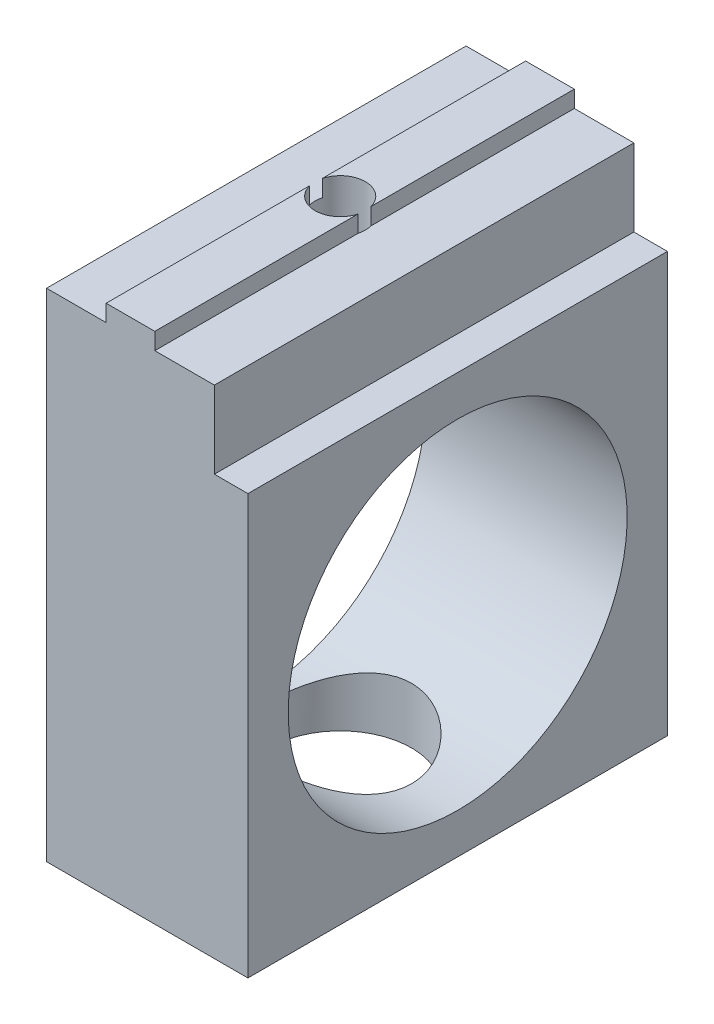
ISO-10303-21;
HEADER;
FILE_DESCRIPTION(('STEP AP214'),'2;1');
FILE_NAME('part.step','',(''),(''),'','','');
FILE_SCHEMA(('AUTOMOTIVE_DESIGN { 1 0 10303 214 1 1 1 1 }'));
ENDSEC;
DATA;
#1=APPLICATION_CONTEXT('core data for automotive mechanical design processes');
#2=APPLICATION_PROTOCOL_DEFINITION('international standard','automotive_design',2000,#1);
#3=PRODUCT_CONTEXT('',#1,'mechanical');
#4=PRODUCT('Part','Part','',(#3));
#5=PRODUCT_RELATED_PRODUCT_CATEGORY('part','',(#4));
#6=PRODUCT_DEFINITION_FORMATION('','',#4);
#7=PRODUCT_DEFINITION_CONTEXT('part definition',#1,'design');
#8=PRODUCT_DEFINITION('design','',#6,#7);
#9=PRODUCT_DEFINITION_SHAPE('','',#8);
#10=(LENGTH_UNIT() NAMED_UNIT(*) SI_UNIT(.MILLI.,.METRE.));
#11=(NAMED_UNIT(*) PLANE_ANGLE_UNIT() SI_UNIT($,.RADIAN.));
#12=(NAMED_UNIT(*) SI_UNIT($,.STERADIAN.) SOLID_ANGLE_UNIT());
#13=UNCERTAINTY_MEASURE_WITH_UNIT(LENGTH_MEASURE(1.E-05),#10,'distance_accuracy_value','');
#14=(GEOMETRIC_REPRESENTATION_CONTEXT(3) GLOBAL_UNCERTAINTY_ASSIGNED_CONTEXT((#13)) GLOBAL_UNIT_ASSIGNED_CONTEXT((#10,
#11,#12)) REPRESENTATION_CONTEXT('',''));
#15=CARTESIAN_POINT('',(0.,0.,0.));
#16=DIRECTION('',(0.,0.,1.));
#17=DIRECTION('',(1.,0.,0.));
#18=AXIS2_PLACEMENT_3D('',#15,#16,#17);
#19=CARTESIAN_POINT('',(1.45,7.,12.5));
#20=DIRECTION('',(-1.,0.,0.));
#21=DIRECTION('',(0.,-1.,0.));
#22=AXIS2_PLACEMENT_3D('',#19,#20,#21);
#23=PLANE('',#22);
#24=DIRECTION('',(0.,0.,-1.));
#25=VECTOR('',#24,1.);
#26=CARTESIAN_POINT('',(1.45,8.,12.5));
#27=LINE('',#26,#25);
#28=CARTESIAN_POINT('',(1.45,8.00000000000001,-0.384057287393411));
#29=VERTEX_POINT('',#28);
#30=CARTESIAN_POINT('',(1.45,8.,-12.5));
#31=VERTEX_POINT('',#30);
#32=EDGE_CURVE('E167',#29,#31,#27,.T.);
#33=ORIENTED_EDGE('',*,*,#32,.F.);
#34=DIRECTION('',(0.,-1.,0.));
#35=VECTOR('',#34,1.);
#36=CARTESIAN_POINT('',(1.45,8.00000000000001,-0.384057287393411));
#37=LINE('',#36,#35);
#38=CARTESIAN_POINT('',(1.45,7.,-0.384057287393411));
#39=VERTEX_POINT('',#38);
#40=EDGE_CURVE('E236',#29,#39,#37,.T.);
#41=ORIENTED_EDGE('',*,*,#40,.T.);
#42=DIRECTION('',(0.,0.,-1.));
#43=VECTOR('',#42,1.);
#44=CARTESIAN_POINT('',(1.45,7.,12.5));
#45=LINE('',#44,#43);
#46=CARTESIAN_POINT('',(1.45,7.,-12.5));
#47=VERTEX_POINT('',#46);
#48=EDGE_CURVE('E166',#39,#47,#45,.T.);
#49=ORIENTED_EDGE('',*,*,#48,.T.);
#50=DIRECTION('',(0.,1.,0.));
#51=VECTOR('',#50,1.);
#52=CARTESIAN_POINT('',(1.45,7.,-12.5));
#53=LINE('',#52,#51);
#54=EDGE_CURVE('E234',#47,#31,#53,.T.);
#55=ORIENTED_EDGE('',*,*,#54,.T.);
#56=EDGE_LOOP('',(#33,#41,#49,#55));
#57=FACE_BOUND('',#56,.T.);
#58=ADVANCED_FACE('F35',(#57),#23,.F.);
#59=CARTESIAN_POINT('',(1.45,8.,12.5));
#60=DIRECTION('',(0.,-1.,0.));
#61=DIRECTION('',(0.,0.,-1.));
#62=AXIS2_PLACEMENT_3D('',#59,#60,#61);
#63=PLANE('',#62);
#64=CARTESIAN_POINT('',(1.45,8.,12.5));
#65=VERTEX_POINT('',#64);
#66=CARTESIAN_POINT('',(1.45,8.00000000000001,0.38405728739342));
#67=VERTEX_POINT('',#66);
#68=EDGE_CURVE('E159',#65,#67,#27,.T.);
#69=ORIENTED_EDGE('',*,*,#68,.T.);
#70=CARTESIAN_POINT('',(0.,8.00000000000001,0.));
#71=DIRECTION('',(0.,-1.,0.));
#72=DIRECTION('',(1.,0.,0.));
#73=AXIS2_PLACEMENT_3D('',#70,#71,#72);
#74=CIRCLE('',#73,1.5);
#75=CARTESIAN_POINT('',(-1.45,8.00000000000001,0.384057287393453));
#76=VERTEX_POINT('',#75);
#77=EDGE_CURVE('E140',#67,#76,#74,.T.);
#78=ORIENTED_EDGE('',*,*,#77,.T.);
#79=DIRECTION('',(0.,0.,-1.));
#80=VECTOR('',#79,1.);
#81=CARTESIAN_POINT('',(-1.45,8.,12.5));
#82=LINE('',#81,#80);
#83=CARTESIAN_POINT('',(-1.45,8.,12.5));
#84=VERTEX_POINT('',#83);
#85=EDGE_CURVE('E170',#84,#76,#82,.T.);
#86=ORIENTED_EDGE('',*,*,#85,.F.);
#87=DIRECTION('',(-1.,0.,0.));
#88=VECTOR('',#87,1.);
#89=CARTESIAN_POINT('',(1.45,8.,12.5));
#90=LINE('',#89,#88);
#91=EDGE_CURVE('E165',#65,#84,#90,.T.);
#92=ORIENTED_EDGE('',*,*,#91,.F.);
#93=EDGE_LOOP('',(#69,#78,#86,#92));
#94=FACE_BOUND('',#93,.T.);
#95=ADVANCED_FACE('F164',(#94),#63,.F.);
#96=CARTESIAN_POINT('',(-1.45,8.,12.5));
#97=DIRECTION('',(1.,0.,0.));
#98=DIRECTION('',(0.,0.,-1.));
#99=AXIS2_PLACEMENT_3D('',#96,#97,#98);
#100=PLANE('',#99);
#101=ORIENTED_EDGE('',*,*,#85,.T.);
#102=DIRECTION('',(0.,-1.,0.));
#103=VECTOR('',#102,1.);
#104=CARTESIAN_POINT('',(-1.45,8.00000000000001,0.384057287393453));
#105=LINE('',#104,#103);
#106=CARTESIAN_POINT('',(-1.45,7.,0.384057287393453));
#107=VERTEX_POINT('',#106);
#108=EDGE_CURVE('E146',#76,#107,#105,.T.);
#109=ORIENTED_EDGE('',*,*,#108,.T.);
#110=DIRECTION('',(0.,0.,-1.));
#111=VECTOR('',#110,1.);
#112=CARTESIAN_POINT('',(-1.45,7.,12.5));
#113=LINE('',#112,#111);
#114=CARTESIAN_POINT('',(-1.45,7.,12.5));
#115=VERTEX_POINT('',#114);
#116=EDGE_CURVE('E303',#115,#107,#113,.T.);
#117=ORIENTED_EDGE('',*,*,#116,.F.);
#118=DIRECTION('',(0.,-1.,0.));
#119=VECTOR('',#118,1.);
#120=CARTESIAN_POINT('',(-1.45,8.,12.5));
#121=LINE('',#120,#119);
#122=EDGE_CURVE('E284',#84,#115,#121,.T.);
#123=ORIENTED_EDGE('',*,*,#122,.F.);
#124=EDGE_LOOP('',(#101,#109,#117,#123));
#125=FACE_BOUND('',#124,.T.);
#126=ADVANCED_FACE('F208',(#125),#100,.F.);
#127=CARTESIAN_POINT('',(-5.,7.,12.5));
#128=DIRECTION('',(1.,0.,0.));
#129=DIRECTION('',(0.,1.,0.));
#130=AXIS2_PLACEMENT_3D('',#127,#128,#129);
#131=PLANE('',#130);
#132=DIRECTION('',(0.,-1.,0.));
#133=VECTOR('',#132,1.);
#134=CARTESIAN_POINT('',(-5.,7.,-12.5));
#135=LINE('',#134,#133);
#136=CARTESIAN_POINT('',(-5.,7.,-12.5));
#137=VERTEX_POINT('',#136);
#138=CARTESIAN_POINT('',(-4.99999999999999,-22.6,-12.5));
#139=VERTEX_POINT('',#138);
#140=EDGE_CURVE('E273',#137,#139,#135,.T.);
#141=ORIENTED_EDGE('',*,*,#140,.T.);
#142=DIRECTION('',(0.,0.,1.));
#143=VECTOR('',#142,1.);
#144=CARTESIAN_POINT('',(-4.99999999999999,-22.6,12.5));
#145=LINE('',#144,#143);
#146=CARTESIAN_POINT('',(-4.99999999999999,-22.6,12.5));
#147=VERTEX_POINT('',#146);
#148=EDGE_CURVE('E246',#139,#147,#145,.T.);
#149=ORIENTED_EDGE('',*,*,#148,.T.);
#150=DIRECTION('',(0.,-1.,0.));
#151=VECTOR('',#150,1.);
#152=CARTESIAN_POINT('',(-5.,7.,12.5));
#153=LINE('',#152,#151);
#154=CARTESIAN_POINT('',(-5.,7.,12.5));
#155=VERTEX_POINT('',#154);
#156=EDGE_CURVE('E274',#155,#147,#153,.T.);
#157=ORIENTED_EDGE('',*,*,#156,.F.);
#158=DIRECTION('',(0.,0.,-1.));
#159=VECTOR('',#158,1.);
#160=CARTESIAN_POINT('',(-5.,7.,12.5));
#161=LINE('',#160,#159);
#162=EDGE_CURVE('E288',#155,#137,#161,.T.);
#163=ORIENTED_EDGE('',*,*,#162,.T.);
#164=EDGE_LOOP('',(#141,#149,#157,#163));
#165=FACE_BOUND('',#164,.T.);
#166=CARTESIAN_POINT('',(-5.,-10.1,0.));
#167=DIRECTION('',(-1.,0.,0.));
#168=DIRECTION('',(0.,-1.,0.));
#169=AXIS2_PLACEMENT_3D('',#166,#167,#168);
#170=CIRCLE('',#169,10.1);
#171=CARTESIAN_POINT('',(-4.99999999999999,-20.2,0.));
#172=VERTEX_POINT('',#171);
#173=EDGE_CURVE('E238',#172,#172,#170,.T.);
#174=ORIENTED_EDGE('',*,*,#173,.F.);
#175=EDGE_LOOP('',(#174));
#176=FACE_BOUND('',#175,.T.);
#177=ADVANCED_FACE('F37',(#165,#176),#131,.F.);
#178=CARTESIAN_POINT('',(5.,0.,12.5));
#179=DIRECTION('',(-1.,0.,0.));
#180=DIRECTION('',(0.,-1.,0.));
#181=AXIS2_PLACEMENT_3D('',#178,#179,#180);
#182=PLANE('',#181);
#183=DIRECTION('',(0.,1.,0.));
#184=VECTOR('',#183,1.);
#185=CARTESIAN_POINT('',(5.,0.,12.5));
#186=LINE('',#185,#184);
#187=CARTESIAN_POINT('',(5.,2.4,12.5));
#188=VERTEX_POINT('',#187);
#189=CARTESIAN_POINT('',(5.,7.,12.5));
#190=VERTEX_POINT('',#189);
#191=EDGE_CURVE('E276',#188,#190,#186,.T.);
#192=ORIENTED_EDGE('',*,*,#191,.F.);
#193=DIRECTION('',(0.,0.,-1.));
#194=VECTOR('',#193,1.);
#195=CARTESIAN_POINT('',(5.,2.4,12.5));
#196=LINE('',#195,#194);
#197=CARTESIAN_POINT('',(5.,2.4,-12.5));
#198=VERTEX_POINT('',#197);
#199=EDGE_CURVE('E264',#188,#198,#196,.T.);
#200=ORIENTED_EDGE('',*,*,#199,.T.);
#201=DIRECTION('',(0.,1.,0.));
#202=VECTOR('',#201,1.);
#203=CARTESIAN_POINT('',(5.,0.,-12.5));
#204=LINE('',#203,#202);
#205=CARTESIAN_POINT('',(5.,7.,-12.5));
#206=VERTEX_POINT('',#205);
#207=EDGE_CURVE('E290',#198,#206,#204,.T.);
#208=ORIENTED_EDGE('',*,*,#207,.T.);
#209=DIRECTION('',(0.,0.,-1.));
#210=VECTOR('',#209,1.);
#211=CARTESIAN_POINT('',(5.,7.,12.5));
#212=LINE('',#211,#210);
#213=EDGE_CURVE('E11',#190,#206,#212,.T.);
#214=ORIENTED_EDGE('',*,*,#213,.F.);
#215=EDGE_LOOP('',(#192,#200,#208,#214));
#216=FACE_BOUND('',#215,.T.);
#217=ADVANCED_FACE('F221',(#216),#182,.F.);
#218=CARTESIAN_POINT('',(5.,7.,12.5));
#219=DIRECTION('',(0.,-1.,0.));
#220=DIRECTION('',(1.,0.,0.));
#221=AXIS2_PLACEMENT_3D('',#218,#219,#220);
#222=PLANE('',#221);
#223=ORIENTED_EDGE('',*,*,#48,.F.);
#224=CARTESIAN_POINT('',(0.,7.,0.));
#225=DIRECTION('',(0.,-1.,0.));
#226=DIRECTION('',(1.,0.,0.));
#227=AXIS2_PLACEMENT_3D('',#224,#225,#226);
#228=CIRCLE('',#227,1.5);
#229=CARTESIAN_POINT('',(1.45,7.,0.384057287393419));
#230=VERTEX_POINT('',#229);
#231=EDGE_CURVE('E162',#39,#230,#228,.T.);
#232=ORIENTED_EDGE('',*,*,#231,.T.);
#233=CARTESIAN_POINT('',(1.45,7.,12.5));
#234=VERTEX_POINT('',#233);
#235=EDGE_CURVE('E48',#234,#230,#45,.T.);
#236=ORIENTED_EDGE('',*,*,#235,.F.);
#237=DIRECTION('',(-1.,0.,0.));
#238=VECTOR('',#237,1.);
#239=CARTESIAN_POINT('',(5.,7.,12.5));
#240=LINE('',#239,#238);
#241=EDGE_CURVE('E279',#190,#234,#240,.T.);
#242=ORIENTED_EDGE('',*,*,#241,.F.);
#243=ORIENTED_EDGE('',*,*,#213,.T.);
#244=DIRECTION('',(-1.,0.,0.));
#245=VECTOR('',#244,1.);
#246=CARTESIAN_POINT('',(5.,7.,-12.5));
#247=LINE('',#246,#245);
#248=EDGE_CURVE('E230',#206,#47,#247,.T.);
#249=ORIENTED_EDGE('',*,*,#248,.T.);
#250=EDGE_LOOP('',(#223,#232,#236,#242,#243,#249));
#251=FACE_BOUND('',#250,.T.);
#252=ADVANCED_FACE('F214',(#251),#222,.F.);
#253=ORIENTED_EDGE('',*,*,#235,.T.);
#254=DIRECTION('',(0.,-1.,0.));
#255=VECTOR('',#254,1.);
#256=CARTESIAN_POINT('',(1.45,8.00000000000001,0.384057287393419));
#257=LINE('',#256,#255);
#258=EDGE_CURVE('E143',#230,#67,#257,.F.);
#259=ORIENTED_EDGE('',*,*,#258,.T.);
#260=ORIENTED_EDGE('',*,*,#68,.F.);
#261=DIRECTION('',(0.,1.,0.));
#262=VECTOR('',#261,1.);
#263=CARTESIAN_POINT('',(1.45,7.,12.5));
#264=LINE('',#263,#262);
#265=EDGE_CURVE('E281',#234,#65,#264,.T.);
#266=ORIENTED_EDGE('',*,*,#265,.F.);
#267=EDGE_LOOP('',(#253,#259,#260,#266));
#268=FACE_BOUND('',#267,.T.);
#269=ADVANCED_FACE('F157',(#268),#23,.F.);
#270=CARTESIAN_POINT('',(-1.45,8.00000000000001,-0.384057287393445));
#271=VERTEX_POINT('',#270);
#272=CARTESIAN_POINT('',(-1.45,8.,-12.5));
#273=VERTEX_POINT('',#272);
#274=EDGE_CURVE('E305',#271,#273,#82,.T.);
#275=ORIENTED_EDGE('',*,*,#274,.F.);
#276=EDGE_CURVE('E152',#271,#29,#74,.T.);
#277=ORIENTED_EDGE('',*,*,#276,.T.);
#278=ORIENTED_EDGE('',*,*,#32,.T.);
#279=DIRECTION('',(-1.,0.,0.));
#280=VECTOR('',#279,1.);
#281=CARTESIAN_POINT('',(1.45,8.,-12.5));
#282=LINE('',#281,#280);
#283=EDGE_CURVE('E294',#31,#273,#282,.T.);
#284=ORIENTED_EDGE('',*,*,#283,.T.);
#285=EDGE_LOOP('',(#275,#277,#278,#284));
#286=FACE_BOUND('',#285,.T.);
#287=ADVANCED_FACE('F210',(#286),#63,.F.);
#288=CARTESIAN_POINT('',(-1.45,7.,-0.384057287393444));
#289=VERTEX_POINT('',#288);
#290=CARTESIAN_POINT('',(-1.45,7.,-12.5));
#291=VERTEX_POINT('',#290);
#292=EDGE_CURVE('E302',#289,#291,#113,.T.);
#293=ORIENTED_EDGE('',*,*,#292,.F.);
#294=DIRECTION('',(0.,-1.,0.));
#295=VECTOR('',#294,1.);
#296=CARTESIAN_POINT('',(-1.45,8.00000000000001,-0.384057287393445));
#297=LINE('',#296,#295);
#298=EDGE_CURVE('E56',#289,#271,#297,.F.);
#299=ORIENTED_EDGE('',*,*,#298,.T.);
#300=ORIENTED_EDGE('',*,*,#274,.T.);
#301=DIRECTION('',(0.,-1.,0.));
#302=VECTOR('',#301,1.);
#303=CARTESIAN_POINT('',(-1.45,8.,-12.5));
#304=LINE('',#303,#302);
#305=EDGE_CURVE('E297',#273,#291,#304,.T.);
#306=ORIENTED_EDGE('',*,*,#305,.T.);
#307=EDGE_LOOP('',(#293,#299,#300,#306));
#308=FACE_BOUND('',#307,.T.);
#309=ADVANCED_FACE('F219',(#308),#100,.F.);
#310=CARTESIAN_POINT('',(-1.45,7.,12.5));
#311=DIRECTION('',(0.,-1.,0.));
#312=DIRECTION('',(1.,0.,0.));
#313=AXIS2_PLACEMENT_3D('',#310,#311,#312);
#314=PLANE('',#313);
#315=ORIENTED_EDGE('',*,*,#116,.T.);
#316=CARTESIAN_POINT('',(0.,7.,0.));
#317=DIRECTION('',(0.,-1.,0.));
#318=DIRECTION('',(1.,0.,0.));
#319=AXIS2_PLACEMENT_3D('',#316,#317,#318);
#320=CIRCLE('',#319,1.5);
#321=EDGE_CURVE('E151',#107,#289,#320,.T.);
#322=ORIENTED_EDGE('',*,*,#321,.T.);
#323=ORIENTED_EDGE('',*,*,#292,.T.);
#324=DIRECTION('',(-1.,0.,0.));
#325=VECTOR('',#324,1.);
#326=CARTESIAN_POINT('',(-1.45,7.,-12.5));
#327=LINE('',#326,#325);
#328=EDGE_CURVE('E277',#291,#137,#327,.T.);
#329=ORIENTED_EDGE('',*,*,#328,.T.);
#330=ORIENTED_EDGE('',*,*,#162,.F.);
#331=DIRECTION('',(-1.,0.,0.));
#332=VECTOR('',#331,1.);
#333=CARTESIAN_POINT('',(-1.45,7.,12.5));
#334=LINE('',#333,#332);
#335=EDGE_CURVE('E286',#115,#155,#334,.T.);
#336=ORIENTED_EDGE('',*,*,#335,.F.);
#337=EDGE_LOOP('',(#315,#322,#323,#329,#330,#336));
#338=FACE_BOUND('',#337,.T.);
#339=ADVANCED_FACE('F310',(#338),#314,.F.);
#340=CARTESIAN_POINT('',(0.,0.,12.5));
#341=DIRECTION('',(0.,0.,1.));
#342=DIRECTION('',(1.,0.,0.));
#343=AXIS2_PLACEMENT_3D('',#340,#341,#342);
#344=PLANE('',#343);
#345=ORIENTED_EDGE('',*,*,#156,.T.);
#346=DIRECTION('',(-1.,0.,0.));
#347=VECTOR('',#346,1.);
#348=CARTESIAN_POINT('',(7.00000000000001,-22.6,12.5));
#349=LINE('',#348,#347);
#350=CARTESIAN_POINT('',(7.00000000000001,-22.6,12.5));
#351=VERTEX_POINT('',#350);
#352=EDGE_CURVE('E266',#351,#147,#349,.T.);
#353=ORIENTED_EDGE('',*,*,#352,.F.);
#354=DIRECTION('',(0.,1.,0.));
#355=VECTOR('',#354,1.);
#356=CARTESIAN_POINT('',(7.00000000000001,-22.6,12.5));
#357=LINE('',#356,#355);
#358=CARTESIAN_POINT('',(7.,2.4,12.5));
#359=VERTEX_POINT('',#358);
#360=EDGE_CURVE('E254',#351,#359,#357,.T.);
#361=ORIENTED_EDGE('',*,*,#360,.T.);
#362=DIRECTION('',(-1.,0.,0.));
#363=VECTOR('',#362,1.);
#364=CARTESIAN_POINT('',(7.,2.4,12.5));
#365=LINE('',#364,#363);
#366=EDGE_CURVE('E64',#359,#188,#365,.T.);
#367=ORIENTED_EDGE('',*,*,#366,.T.);
#368=ORIENTED_EDGE('',*,*,#191,.T.);
#369=ORIENTED_EDGE('',*,*,#241,.T.);
#370=ORIENTED_EDGE('',*,*,#265,.T.);
#371=ORIENTED_EDGE('',*,*,#91,.T.);
#372=ORIENTED_EDGE('',*,*,#122,.T.);
#373=ORIENTED_EDGE('',*,*,#335,.T.);
#374=EDGE_LOOP('',(#345,#353,#361,#367,#368,#369,#370,#371,#372,#373));
#375=FACE_BOUND('',#374,.T.);
#376=ADVANCED_FACE('F324',(#375),#344,.T.);
#377=CARTESIAN_POINT('',(0.,0.,-12.5));
#378=DIRECTION('',(0.,0.,1.));
#379=DIRECTION('',(1.,0.,0.));
#380=AXIS2_PLACEMENT_3D('',#377,#378,#379);
#381=PLANE('',#380);
#382=ORIENTED_EDGE('',*,*,#207,.F.);
#383=DIRECTION('',(-1.,0.,0.));
#384=VECTOR('',#383,1.);
#385=CARTESIAN_POINT('',(7.,2.4,-12.5));
#386=LINE('',#385,#384);
#387=CARTESIAN_POINT('',(7.,2.4,-12.5));
#388=VERTEX_POINT('',#387);
#389=EDGE_CURVE('E262',#388,#198,#386,.T.);
#390=ORIENTED_EDGE('',*,*,#389,.F.);
#391=DIRECTION('',(0.,-1.,0.));
#392=VECTOR('',#391,1.);
#393=CARTESIAN_POINT('',(7.00000000000001,-22.6,-12.5));
#394=LINE('',#393,#392);
#395=CARTESIAN_POINT('',(7.00000000000001,-22.6,-12.5));
#396=VERTEX_POINT('',#395);
#397=EDGE_CURVE('E248',#388,#396,#394,.T.);
#398=ORIENTED_EDGE('',*,*,#397,.T.);
#399=DIRECTION('',(-1.,0.,0.));
#400=VECTOR('',#399,1.);
#401=CARTESIAN_POINT('',(7.00000000000001,-22.6,-12.5));
#402=LINE('',#401,#400);
#403=EDGE_CURVE('E259',#396,#139,#402,.T.);
#404=ORIENTED_EDGE('',*,*,#403,.T.);
#405=ORIENTED_EDGE('',*,*,#140,.F.);
#406=ORIENTED_EDGE('',*,*,#328,.F.);
#407=ORIENTED_EDGE('',*,*,#305,.F.);
#408=ORIENTED_EDGE('',*,*,#283,.F.);
#409=ORIENTED_EDGE('',*,*,#54,.F.);
#410=ORIENTED_EDGE('',*,*,#248,.F.);
#411=EDGE_LOOP('',(#382,#390,#398,#404,#405,#406,#407,#408,#409,#410));
#412=FACE_BOUND('',#411,.T.);
#413=ADVANCED_FACE('F319',(#412),#381,.F.);
#414=CARTESIAN_POINT('',(7.,2.4,12.5));
#415=DIRECTION('',(0.,1.,0.));
#416=DIRECTION('',(-1.,0.,0.));
#417=AXIS2_PLACEMENT_3D('',#414,#415,#416);
#418=PLANE('',#417);
#419=ORIENTED_EDGE('',*,*,#199,.F.);
#420=ORIENTED_EDGE('',*,*,#366,.F.);
#421=DIRECTION('',(0.,0.,-1.));
#422=VECTOR('',#421,1.);
#423=CARTESIAN_POINT('',(7.,2.4,12.5));
#424=LINE('',#423,#422);
#425=EDGE_CURVE('E256',#359,#388,#424,.T.);
#426=ORIENTED_EDGE('',*,*,#425,.T.);
#427=ORIENTED_EDGE('',*,*,#389,.T.);
#428=EDGE_LOOP('',(#419,#420,#426,#427));
#429=FACE_BOUND('',#428,.T.);
#430=ADVANCED_FACE('F347',(#429),#418,.T.);
#431=CARTESIAN_POINT('',(7.00000000000001,-22.6,12.5));
#432=DIRECTION('',(0.,-1.,0.));
#433=DIRECTION('',(1.,0.,0.));
#434=AXIS2_PLACEMENT_3D('',#431,#432,#433);
#435=PLANE('',#434);
#436=CARTESIAN_POINT('',(0.,-22.6,0.));
#437=DIRECTION('',(0.,1.,0.));
#438=DIRECTION('',(-1.,0.,0.));
#439=AXIS2_PLACEMENT_3D('',#436,#437,#438);
#440=CIRCLE('',#439,4.25);
#441=CARTESIAN_POINT('',(-4.24999999999999,-22.6,0.));
#442=VERTEX_POINT('',#441);
#443=EDGE_CURVE('E177',#442,#442,#440,.T.);
#444=ORIENTED_EDGE('',*,*,#443,.T.);
#445=EDGE_LOOP('',(#444));
#446=FACE_BOUND('',#445,.T.);
#447=ORIENTED_EDGE('',*,*,#148,.F.);
#448=ORIENTED_EDGE('',*,*,#403,.F.);
#449=DIRECTION('',(0.,0.,1.));
#450=VECTOR('',#449,1.);
#451=CARTESIAN_POINT('',(7.00000000000001,-22.6,12.5));
#452=LINE('',#451,#450);
#453=EDGE_CURVE('E251',#396,#351,#452,.T.);
#454=ORIENTED_EDGE('',*,*,#453,.T.);
#455=ORIENTED_EDGE('',*,*,#352,.T.);
#456=EDGE_LOOP('',(#447,#448,#454,#455));
#457=FACE_BOUND('',#456,.T.);
#458=ADVANCED_FACE('F337',(#446,#457),#435,.T.);
#459=CARTESIAN_POINT('',(7.,0.,0.));
#460=DIRECTION('',(-1.,0.,0.));
#461=DIRECTION('',(0.,-1.,0.));
#462=AXIS2_PLACEMENT_3D('',#459,#460,#461);
#463=PLANE('',#462);
#464=CARTESIAN_POINT('',(7.,-10.1,0.));
#465=DIRECTION('',(-1.,0.,0.));
#466=DIRECTION('',(0.,-1.,0.));
#467=AXIS2_PLACEMENT_3D('',#464,#465,#466);
#468=CIRCLE('',#467,10.1);
#469=CARTESIAN_POINT('',(7.00000000000001,-20.2,0.));
#470=VERTEX_POINT('',#469);
#471=EDGE_CURVE('E241',#470,#470,#468,.T.);
#472=ORIENTED_EDGE('',*,*,#471,.T.);
#473=EDGE_LOOP('',(#472));
#474=FACE_BOUND('',#473,.T.);
#475=ORIENTED_EDGE('',*,*,#397,.F.);
#476=ORIENTED_EDGE('',*,*,#425,.F.);
#477=ORIENTED_EDGE('',*,*,#360,.F.);
#478=ORIENTED_EDGE('',*,*,#453,.F.);
#479=EDGE_LOOP('',(#475,#476,#477,#478));
#480=FACE_BOUND('',#479,.T.);
#481=ADVANCED_FACE('F200',(#474,#480),#463,.F.);
#482=CARTESIAN_POINT('',(7.,-10.1,0.));
#483=DIRECTION('',(-1.,0.,0.));
#484=DIRECTION('',(0.,-1.,0.));
#485=AXIS2_PLACEMENT_3D('',#482,#483,#484);
#486=CYLINDRICAL_SURFACE('',#485,10.1);
#487=CARTESIAN_POINT('',(4.25,-20.2,0.));
#488=CARTESIAN_POINT('',(4.24999916870078,-20.1999993401639,0.11377764630311));
#489=CARTESIAN_POINT('',(4.24542462345952,-20.1980720469688,0.227592723507053));
#490=CARTESIAN_POINT('',(4.22717078769183,-20.1904116257658,0.454409486144817));
#491=CARTESIAN_POINT('',(4.21348581672885,-20.1846761233093,0.567410619615356));
#492=CARTESIAN_POINT('',(4.17711223637137,-20.1695327597285,0.791951117785531));
#493=CARTESIAN_POINT('',(4.15440539521775,-20.1601174629606,0.903487047116962));
#494=CARTESIAN_POINT('',(4.10022897735091,-20.137867227895,1.12407587274755));
#495=CARTESIAN_POINT('',(4.06875581912195,-20.1250308920101,1.23312773442935));
#496=CARTESIAN_POINT('',(3.96187843828382,-20.081966805788,1.55459794154036));
#497=CARTESIAN_POINT('',(3.87384753121247,-20.0471104022422,1.76235587469051));
#498=CARTESIAN_POINT('',(3.66712871437611,-19.9684471904876,2.15984723156004));
#499=CARTESIAN_POINT('',(3.54844975194106,-19.9246429952572,2.34958589371375));
#500=CARTESIAN_POINT('',(3.27741490142435,-19.8299573254664,2.71575509086892));
#501=CARTESIAN_POINT('',(3.12374725989065,-19.7788411562843,2.89115326393071));
#502=CARTESIAN_POINT('',(2.78974256480194,-19.6762714632287,3.2146339960046));
#503=CARTESIAN_POINT('',(2.60939130203537,-19.6248177736605,3.36270190646281));
#504=CARTESIAN_POINT('',(2.31714373979756,-19.5502464469707,3.56488033766333));
#505=CARTESIAN_POINT('',(2.21333978018848,-19.5252617974861,3.63025057387574));
#506=CARTESIAN_POINT('',(2.00010059833862,-19.4774794870606,3.75195236236248));
#507=CARTESIAN_POINT('',(1.89066769803466,-19.4546809352955,3.80828760270197));
#508=CARTESIAN_POINT('',(1.6668468838964,-19.4120249878173,3.91143324719165));
#509=CARTESIAN_POINT('',(1.55245879834372,-19.3921676941368,3.95824332093326));
#510=CARTESIAN_POINT('',(1.31957552947951,-19.3561093464323,4.04184535537153));
#511=CARTESIAN_POINT('',(1.20108250750518,-19.3399064010791,4.07864250036346));
#512=CARTESIAN_POINT('',(0.966670526796628,-19.312440872283,4.14029190801413));
#513=CARTESIAN_POINT('',(0.850904505281726,-19.3009771525952,4.1656360514989));
#514=CARTESIAN_POINT('',(0.617372496691031,-19.282326069452,4.20658961736928));
#515=CARTESIAN_POINT('',(0.499607465572867,-19.275136718063,4.22220356526106));
#516=CARTESIAN_POINT('',(0.263025149258758,-19.2652997135873,4.24351503956202));
#517=CARTESIAN_POINT('',(0.144208157297223,-19.2626508325672,4.24921524706788));
#518=CARTESIAN_POINT('',(-0.0934931992466683,-19.2619930114829,4.25063345705695));
#519=CARTESIAN_POINT('',(-0.212377559825971,-19.2639838198021,4.24635200085928));
#520=CARTESIAN_POINT('',(-0.439871575095912,-19.272191946751,4.22859101174888));
#521=CARTESIAN_POINT('',(-0.548552847676946,-19.2780639492272,4.2158626668795));
#522=CARTESIAN_POINT('',(-0.764368651320207,-19.2934836950529,4.18212739917339));
#523=CARTESIAN_POINT('',(-0.871502665553624,-19.3030326384324,4.1611177735516));
#524=CARTESIAN_POINT('',(-1.18944294814658,-19.3367774211028,4.0859572041821));
#525=CARTESIAN_POINT('',(-1.3969744875778,-19.3660787250762,4.0196595898506));
#526=CARTESIAN_POINT('',(-1.80221699149008,-19.4356631396098,3.85531340098152));
#527=CARTESIAN_POINT('',(-1.99962131686252,-19.4761685889483,3.7566134973107));
#528=CARTESIAN_POINT('',(-2.37587390164089,-19.5635489881504,3.53070710773982));
#529=CARTESIAN_POINT('',(-2.55471472066026,-19.6104264747196,3.4034892556955));
#530=CARTESIAN_POINT('',(-2.90497969931762,-19.7101923082247,3.11127034049515));
#531=CARTESIAN_POINT('',(-3.07442968144085,-19.7632501454596,2.94395516947665));
#532=CARTESIAN_POINT('',(-3.38353786674595,-19.8659892849172,2.58276674762287));
#533=CARTESIAN_POINT('',(-3.52318881310537,-19.9156697626646,2.38888704648286));
#534=CARTESIAN_POINT('',(-3.77170450306108,-20.0075515670945,1.97397467688011));
#535=CARTESIAN_POINT('',(-3.87975121603533,-20.0495451142215,1.75240262021397));
#536=CARTESIAN_POINT('',(-4.05634123062636,-20.11972035534,1.29200812290339));
#537=CARTESIAN_POINT('',(-4.12490681056376,-20.147909837311,1.05319549651732));
#538=CARTESIAN_POINT('',(-4.21642213468257,-20.1858369394506,0.58157775235408));
#539=CARTESIAN_POINT('',(-4.24201934378879,-20.1966435990836,0.349372278063863));
#540=CARTESIAN_POINT('',(-4.25478321644851,-20.2020111521159,-0.116249401341069));
#541=CARTESIAN_POINT('',(-4.24196119412343,-20.1965768283413,-0.349665229807326));
#542=CARTESIAN_POINT('',(-4.18013247099369,-20.1707644803263,-0.798582536898426));
#543=CARTESIAN_POINT('',(-4.13299830279189,-20.1511601417285,-1.01439150674448));
#544=CARTESIAN_POINT('',(-4.00650339871252,-20.0998121029304,-1.43479449197721));
#545=CARTESIAN_POINT('',(-3.92713861166173,-20.0680668767309,-1.63938709387098));
#546=CARTESIAN_POINT('',(-3.73584970281031,-19.9942437474027,-2.03874523738211));
#547=CARTESIAN_POINT('',(-3.6229887028209,-19.9518748860477,-2.23300641959664));
#548=CARTESIAN_POINT('',(-3.36892752023861,-19.8613067144011,-2.60053343808759));
#549=CARTESIAN_POINT('',(-3.22771540635837,-19.8131049527952,-2.77379038553841));
#550=CARTESIAN_POINT('',(-2.90898044954587,-19.7117216012545,-3.10764061711089));
#551=CARTESIAN_POINT('',(-2.7295622575655,-19.6584329841244,-3.26639295935012));
#552=CARTESIAN_POINT('',(-2.34566654056335,-19.5559812182065,-3.55211513300825));
#553=CARTESIAN_POINT('',(-2.1411829156017,-19.5068190785647,-3.67907720496208));
#554=CARTESIAN_POINT('',(-1.81781165547973,-19.4402631738416,-3.84357300276797));
#555=CARTESIAN_POINT('',(-1.7062667713102,-19.4191337013593,-3.89438546127586));
#556=CARTESIAN_POINT('',(-1.47872123155277,-19.3801713544416,-3.98634111956117));
#557=CARTESIAN_POINT('',(-1.36272256978823,-19.3623370251806,-4.02748858867718));
#558=CARTESIAN_POINT('',(-1.12715392803486,-19.3306206877904,-4.09965820610324));
#559=CARTESIAN_POINT('',(-1.00758568248863,-19.3167367936196,-4.13068518723965));
#560=CARTESIAN_POINT('',(-0.765782776325098,-19.2934461411652,-4.1822664131525));
#561=CARTESIAN_POINT('',(-0.643548374823606,-19.284038949814,-4.20282167095717));
#562=CARTESIAN_POINT('',(-0.407132442197533,-19.2706290720344,-4.2319968730955));
#563=CARTESIAN_POINT('',(-0.293070935255785,-19.266260477267,-4.24142623961436));
#564=CARTESIAN_POINT('',(-0.0644349562189331,-19.2618002621067,-4.25105217008484));
#565=CARTESIAN_POINT('',(0.0501396746317786,-19.2617100721757,-4.25124564606597));
#566=CARTESIAN_POINT('',(0.278797740737614,-19.2658156694595,-4.24238727434381));
#567=CARTESIAN_POINT('',(0.392881404939353,-19.2700091758877,-4.23334034654826));
#568=CARTESIAN_POINT('',(0.619740097172795,-19.2825220469433,-4.20612632561348));
#569=CARTESIAN_POINT('',(0.732514615583555,-19.2908429665724,-4.18795579512769));
#570=CARTESIAN_POINT('',(1.05666085054312,-19.3206014499363,-4.12223716683287));
#571=CARTESIAN_POINT('',(1.26532275383641,-19.3471022612841,-4.0629705884357));
#572=CARTESIAN_POINT('',(1.6696533256859,-19.4110249202353,-3.91424167414549));
#573=CARTESIAN_POINT('',(1.86531830965457,-19.448449848709,-3.82477081878593));
#574=CARTESIAN_POINT('',(2.25125554740979,-19.5328189339854,-3.61189400585607));
#575=CARTESIAN_POINT('',(2.44047699179106,-19.5802034501133,-3.48675582919971));
#576=CARTESIAN_POINT('',(2.79622250363865,-19.6779449791708,-3.20853941870862));
#577=CARTESIAN_POINT('',(2.96273841430387,-19.7283030510679,-3.05545118996903));
#578=CARTESIAN_POINT('',(3.28128164359758,-19.8308721393137,-2.71191230952513));
#579=CARTESIAN_POINT('',(3.43128945318176,-19.8829394091741,-2.51952198117538));
#580=CARTESIAN_POINT('',(3.63045873230296,-19.9551467634489,-2.21296171140339));
#581=CARTESIAN_POINT('',(3.69258179136462,-19.9782501687248,-2.10768529537061));
#582=CARTESIAN_POINT('',(3.80771113493119,-20.0218607901865,-1.89176542229305));
#583=CARTESIAN_POINT('',(3.86072162777143,-20.0423692036216,-1.78112447310972));
#584=CARTESIAN_POINT('',(3.95639128064067,-20.07991113154,-1.55695119049381));
#585=CARTESIAN_POINT('',(3.99919715164892,-20.0969932540866,-1.44348953184431));
#586=CARTESIAN_POINT('',(4.07504797791253,-20.1275775131866,-1.21293016316115));
#587=CARTESIAN_POINT('',(4.10809757361391,-20.1410813513908,-1.09583421111673));
#588=CARTESIAN_POINT('',(4.16402301383949,-20.164091590176,-0.85916478137226));
#589=CARTESIAN_POINT('',(4.18692387120227,-20.1736078155386,-0.739598163602375));
#590=CARTESIAN_POINT('',(4.22238719179982,-20.1883988444742,-0.498742446441691));
#591=CARTESIAN_POINT('',(4.23495718427362,-20.1936767369229,-0.377454667151449));
#592=CARTESIAN_POINT('',(4.24486084024133,-20.1978384278464,-0.213259253777592));
#593=CARTESIAN_POINT('',(4.24678747085491,-20.1986485518974,-0.170636023257769));
#594=CARTESIAN_POINT('',(4.24935720915673,-20.1997294627773,-0.0853436171624125));
#595=CARTESIAN_POINT('',(4.25000031179438,-20.2000002474839,-0.0426744414067474));
#596=CARTESIAN_POINT('',(4.25,-20.2,0.));
#597=B_SPLINE_CURVE_WITH_KNOTS('',3,(#487,#488,#489,#490,#491,#492,#493,#494,#495,#496,#497,
#498,#499,#500,#501,#502,#503,#504,#505,#506,#507,#508,#509,#510,#511,#512,#513,#514,#515,#516,
#517,#518,#519,#520,#521,#522,#523,#524,#525,#526,#527,#528,#529,#530,#531,#532,#533,#534,#535,
#536,#537,#538,#539,#540,#541,#542,#543,#544,#545,#546,#547,#548,#549,#550,#551,#552,#553,#554,
#555,#556,#557,#558,#559,#560,#561,#562,#563,#564,#565,#566,#567,#568,#569,#570,#571,#572,#573,
#574,#575,#576,#577,#578,#579,#580,#581,#582,#583,#584,#585,#586,#587,#588,#589,#590,#591,#592,
#593,#594,#595,#596),.UNSPECIFIED.,.T.,.F.,(4,2,2,2,2,2,2,2,2,2,2,2,2,2,2,2,2,2,2,2,2,2,2,2,2,2,
2,2,2,2,2,2,2,2,2,2,2,2,2,2,2,2,2,2,2,2,2,2,2,2,2,2,2,2,4),(0.,0.34128938543471,
0.682791767579391,1.02498781050077,1.36732386464291,2.04891141589506,2.73030021038722,
3.44344555530537,4.15697203099774,4.53215203254459,4.90717849450232,5.28221796314575,
5.65706288022281,6.01376762661007,6.37030634584287,6.72674862685238,7.0831715779644,
7.41151583196298,7.73996733745576,8.39631398325576,9.06675685652651,9.73746741883392,
10.4660982885299,11.1949063963625,11.9411810666194,12.6870342170529,13.3849725749316,
14.0827054163838,14.7449699424603,15.4073177365349,16.090289614058,16.7735495183347,
17.5065650439244,18.2397593121275,18.612489449025,18.9850546280124,19.357441634978,
19.7297926106041,20.0729496569987,20.4162214353091,20.7593105391837,21.102529000076,
21.7549722750628,22.4075997332141,23.0998986307434,23.792445580148,24.5368670635008,
24.9096906712216,25.2823416374969,25.6492592313282,26.0160020233204,26.3818358352899,
26.7474027868415,26.8754092718172,27.0034162604895),.UNSPECIFIED.);
#598=CARTESIAN_POINT('',(4.25,-20.2,0.));
#599=VERTEX_POINT('',#598);
#600=EDGE_CURVE('E39',#599,#599,#597,.T.);
#601=ORIENTED_EDGE('',*,*,#600,.T.);
#602=EDGE_LOOP('',(#601));
#603=FACE_BOUND('',#602,.T.);
#604=CARTESIAN_POINT('',(-4.25,0.,0.));
#605=CARTESIAN_POINT('',(-4.24999916870078,-6.59836047781802E-07,0.113777646303102));
#606=CARTESIAN_POINT('',(-4.24542462345952,-0.00192795303115628,0.227592723507045));
#607=CARTESIAN_POINT('',(-4.22717078769183,-0.00958837423420484,0.454409486144809));
#608=CARTESIAN_POINT('',(-4.21348581672885,-0.0153238766907312,0.567410619615349));
#609=CARTESIAN_POINT('',(-4.17711223637137,-0.030467240271483,0.791951117785524));
#610=CARTESIAN_POINT('',(-4.15440539521775,-0.0398825370394114,0.903487047116955));
#611=CARTESIAN_POINT('',(-4.10022897735091,-0.0621327721049806,1.12407587274754));
#612=CARTESIAN_POINT('',(-4.06875581912195,-0.0749691079898455,1.23312773442934));
#613=CARTESIAN_POINT('',(-3.96187843828382,-0.118033194212027,1.55459794154035));
#614=CARTESIAN_POINT('',(-3.87384753121247,-0.15288959775777,1.7623558746905));
#615=CARTESIAN_POINT('',(-3.66712871437611,-0.231552809512433,2.15984723156004));
#616=CARTESIAN_POINT('',(-3.54844975194106,-0.275357004742762,2.34958589371374));
#617=CARTESIAN_POINT('',(-3.27741490142434,-0.370042674533587,2.71575509086891));
#618=CARTESIAN_POINT('',(-3.12374725989065,-0.421158843715715,2.8911532639307));
#619=CARTESIAN_POINT('',(-2.78974256480194,-0.523728536771311,3.21463399600459));
#620=CARTESIAN_POINT('',(-2.60939130203537,-0.575182226339467,3.36270190646281));
#621=CARTESIAN_POINT('',(-2.31714373979756,-0.649753553029261,3.56488033766333));
#622=CARTESIAN_POINT('',(-2.21333978018849,-0.674738202513907,3.63025057387573));
#623=CARTESIAN_POINT('',(-2.00010059833862,-0.722520512939433,3.75195236236248));
#624=CARTESIAN_POINT('',(-1.89066769803466,-0.745319064704484,3.80828760270197));
#625=CARTESIAN_POINT('',(-1.66684688389641,-0.787975012182723,3.91143324719165));
#626=CARTESIAN_POINT('',(-1.55245879834373,-0.807832305863173,3.95824332093326));
#627=CARTESIAN_POINT('',(-1.31957552947952,-0.84389065356768,4.04184535537153));
#628=CARTESIAN_POINT('',(-1.20108250750518,-0.860093598920897,4.07864250036346));
#629=CARTESIAN_POINT('',(-0.966670526796631,-0.88755912771698,4.14029190801413));
#630=CARTESIAN_POINT('',(-0.85090450528173,-0.899022847404806,4.1656360514989));
#631=CARTESIAN_POINT('',(-0.617372496691035,-0.917673930547972,4.20658961736928));
#632=CARTESIAN_POINT('',(-0.499607465572871,-0.924863281936986,4.22220356526106));
#633=CARTESIAN_POINT('',(-0.263025149258762,-0.93470028641272,4.24351503956202));
#634=CARTESIAN_POINT('',(-0.144208157297226,-0.937349167432779,4.24921524706788));
#635=CARTESIAN_POINT('',(0.0934931992466644,-0.938006988517067,4.25063345705695));
#636=CARTESIAN_POINT('',(0.212377559825967,-0.936016180197928,4.24635200085928));
#637=CARTESIAN_POINT('',(0.439871575095908,-0.927808053249041,4.22859101174888));
#638=CARTESIAN_POINT('',(0.548552847676943,-0.921936050772788,4.2158626668795));
#639=CARTESIAN_POINT('',(0.764368651320203,-0.906516304947118,4.18212739917339));
#640=CARTESIAN_POINT('',(0.871502665553621,-0.896967361567603,4.1611177735516));
#641=CARTESIAN_POINT('',(1.18944294814657,-0.863222578897158,4.08595720418211));
#642=CARTESIAN_POINT('',(1.3969744875778,-0.833921274923807,4.0196595898506));
#643=CARTESIAN_POINT('',(1.80221699149008,-0.76433686039021,3.85531340098153));
#644=CARTESIAN_POINT('',(1.99962131686251,-0.723831411051725,3.7566134973107));
#645=CARTESIAN_POINT('',(2.37587390164088,-0.636451011849621,3.53070710773983));
#646=CARTESIAN_POINT('',(2.55471472066026,-0.589573525280376,3.40348925569551));
#647=CARTESIAN_POINT('',(2.90497969931761,-0.489807691775293,3.11127034049516));
#648=CARTESIAN_POINT('',(3.07442968144085,-0.436749854540426,2.94395516947666));
#649=CARTESIAN_POINT('',(3.38353786674595,-0.334010715082783,2.58276674762288));
#650=CARTESIAN_POINT('',(3.52318881310536,-0.284330237335436,2.38888704648287));
#651=CARTESIAN_POINT('',(3.77170450306108,-0.192448432905484,1.97397467688012));
#652=CARTESIAN_POINT('',(3.87975121603533,-0.150454885778525,1.75240262021398));
#653=CARTESIAN_POINT('',(4.05634123062636,-0.0802796446599819,1.2920081229034));
#654=CARTESIAN_POINT('',(4.12490681056376,-0.0520901626890238,1.05319549651733));
#655=CARTESIAN_POINT('',(4.21642213468257,-0.0141630605494373,0.581577752354091));
#656=CARTESIAN_POINT('',(4.24201934378879,-0.00335640091637155,0.349372278063874));
#657=CARTESIAN_POINT('',(4.25478321644851,0.00201115211590363,-0.116249401341058));
#658=CARTESIAN_POINT('',(4.24196119412344,-0.0034231716587253,-0.349665229807316));
#659=CARTESIAN_POINT('',(4.1801324709937,-0.0292355196736507,-0.798582536898417));
#660=CARTESIAN_POINT('',(4.1329983027919,-0.0488398582714477,-1.01439150674447));
#661=CARTESIAN_POINT('',(4.00650339871252,-0.100187897069605,-1.43479449197721));
#662=CARTESIAN_POINT('',(3.92713861166173,-0.131933123269099,-1.63938709387097));
#663=CARTESIAN_POINT('',(3.73584970281032,-0.205756252597309,-2.0387452373821));
#664=CARTESIAN_POINT('',(3.6229887028209,-0.248125113952335,-2.23300641959663));
#665=CARTESIAN_POINT('',(3.36892752023862,-0.338693285598865,-2.60053343808758));
#666=CARTESIAN_POINT('',(3.22771540635838,-0.386895047204783,-2.77379038553841));
#667=CARTESIAN_POINT('',(2.90898044954588,-0.488278398745457,-3.10764061711088));
#668=CARTESIAN_POINT('',(2.72956225756551,-0.541567015875619,-3.26639295935012));
#669=CARTESIAN_POINT('',(2.34566654056336,-0.644018781793468,-3.55211513300825));
#670=CARTESIAN_POINT('',(2.14118291560172,-0.693180921435258,-3.67907720496208));
#671=CARTESIAN_POINT('',(1.81781165547974,-0.759736826158415,-3.84357300276797));
#672=CARTESIAN_POINT('',(1.70626677131021,-0.780866298640719,-3.89438546127586));
#673=CARTESIAN_POINT('',(1.47872123155278,-0.819828645558389,-3.98634111956117));
#674=CARTESIAN_POINT('',(1.36272256978824,-0.837662974819421,-4.02748858867717));
#675=CARTESIAN_POINT('',(1.12715392803487,-0.869379312209623,-4.09965820610323));
#676=CARTESIAN_POINT('',(1.00758568248864,-0.88326320638041,-4.13068518723964));
#677=CARTESIAN_POINT('',(0.765782776325112,-0.906553858834742,-4.1822664131525));
#678=CARTESIAN_POINT('',(0.643548374823619,-0.915961050186026,-4.20282167095717));
#679=CARTESIAN_POINT('',(0.407132442197547,-0.929370927965569,-4.2319968730955));
#680=CARTESIAN_POINT('',(0.2930709352558,-0.933739522732978,-4.24142623961436));
#681=CARTESIAN_POINT('',(0.0644349562189485,-0.938199737893242,-4.25105217008484));
#682=CARTESIAN_POINT('',(-0.0501396746317643,-0.93828992782431,-4.25124564606597));
#683=CARTESIAN_POINT('',(-0.278797740737603,-0.934184330540502,-4.24238727434381));
#684=CARTESIAN_POINT('',(-0.392881404939343,-0.929990824112278,-4.23334034654826));
#685=CARTESIAN_POINT('',(-0.619740097172784,-0.91747795305673,-4.20612632561348));
#686=CARTESIAN_POINT('',(-0.732514615583542,-0.909157033427573,-4.18795579512769));
#687=CARTESIAN_POINT('',(-1.0566608505431,-0.879398550063688,-4.12223716683287));
#688=CARTESIAN_POINT('',(-1.2653227538364,-0.852897738715926,-4.0629705884357));
#689=CARTESIAN_POINT('',(-1.66965332568589,-0.788975079764714,-3.9142416741455));
#690=CARTESIAN_POINT('',(-1.86531830965456,-0.751550151290941,-3.82477081878594));
#691=CARTESIAN_POINT('',(-2.25125554740978,-0.667181066014579,-3.61189400585608));
#692=CARTESIAN_POINT('',(-2.44047699179104,-0.61979654988666,-3.48675582919971));
#693=CARTESIAN_POINT('',(-2.79622250363864,-0.522055020829155,-3.20853941870863));
#694=CARTESIAN_POINT('',(-2.96273841430386,-0.471696948932126,-3.05545118996904));
#695=CARTESIAN_POINT('',(-3.28128164359757,-0.369127860686251,-2.71191230952514));
#696=CARTESIAN_POINT('',(-3.43128945318174,-0.317060590825874,-2.51952198117539));
#697=CARTESIAN_POINT('',(-3.63045873230294,-0.244853236551117,-2.2129617114034));
#698=CARTESIAN_POINT('',(-3.69258179136461,-0.221749831275143,-2.10768529537062));
#699=CARTESIAN_POINT('',(-3.80771113493118,-0.178139209813494,-1.89176542229306));
#700=CARTESIAN_POINT('',(-3.86072162777142,-0.15763079637838,-1.78112447310973));
#701=CARTESIAN_POINT('',(-3.95639128064066,-0.120088868460003,-1.55695119049382));
#702=CARTESIAN_POINT('',(-3.99919715164892,-0.103006745913421,-1.44348953184432));
#703=CARTESIAN_POINT('',(-4.07504797791252,-0.072422486813389,-1.21293016316117));
#704=CARTESIAN_POINT('',(-4.1080975736139,-0.0589186486092051,-1.09583421111674));
#705=CARTESIAN_POINT('',(-4.16402301383949,-0.0359084098239499,-0.859164781372271));
#706=CARTESIAN_POINT('',(-4.18692387120227,-0.0263921844614225,-0.739598163602387));
#707=CARTESIAN_POINT('',(-4.22238719179982,-0.011601155525776,-0.498742446441703));
#708=CARTESIAN_POINT('',(-4.23495718427362,-0.00632326307707353,-0.37745466715146));
#709=CARTESIAN_POINT('',(-4.24486084024132,-0.00216157215360677,-0.213259253777601));
#710=CARTESIAN_POINT('',(-4.2467874708549,-0.00135144810258665,-0.170636023257777));
#711=CARTESIAN_POINT('',(-4.24935720915673,-0.000270537222696719,-0.0853436171624188));
#712=CARTESIAN_POINT('',(-4.25000031179438,2.47483906570916E-07,-0.0426744414067545));
#713=CARTESIAN_POINT('',(-4.25,0.,0.));
#714=B_SPLINE_CURVE_WITH_KNOTS('',3,(#604,#605,#606,#607,#608,#609,#610,#611,#612,#613,#614,
#615,#616,#617,#618,#619,#620,#621,#622,#623,#624,#625,#626,#627,#628,#629,#630,#631,#632,#633,
#634,#635,#636,#637,#638,#639,#640,#641,#642,#643,#644,#645,#646,#647,#648,#649,#650,#651,#652,
#653,#654,#655,#656,#657,#658,#659,#660,#661,#662,#663,#664,#665,#666,#667,#668,#669,#670,#671,
#672,#673,#674,#675,#676,#677,#678,#679,#680,#681,#682,#683,#684,#685,#686,#687,#688,#689,#690,
#691,#692,#693,#694,#695,#696,#697,#698,#699,#700,#701,#702,#703,#704,#705,#706,#707,#708,#709,
#710,#711,#712,#713),.UNSPECIFIED.,.T.,.F.,(4,2,2,2,2,2,2,2,2,2,2,2,2,2,2,2,2,2,2,2,2,2,2,2,2,2,
2,2,2,2,2,2,2,2,2,2,2,2,2,2,2,2,2,2,2,2,2,2,2,2,2,2,2,2,4),(0.,0.34128938543471,
0.682791767579391,1.02498781050077,1.36732386464291,2.04891141589506,2.73030021038722,
3.44344555530537,4.15697203099774,4.53215203254459,4.90717849450231,5.28221796314575,
5.6570628802228,6.01376762661007,6.37030634584286,6.72674862685238,7.0831715779644,
7.41151583196298,7.73996733745576,8.39631398325576,9.06675685652651,9.73746741883392,
10.4660982885299,11.1949063963625,11.9411810666194,12.6870342170529,13.3849725749316,
14.0827054163838,14.7449699424603,15.4073177365349,16.090289614058,16.7735495183347,
17.5065650439244,18.2397593121275,18.612489449025,18.9850546280124,19.357441634978,
19.7297926106041,20.0729496569987,20.4162214353091,20.7593105391837,21.102529000076,
21.7549722750628,22.4075997332141,23.0998986307434,23.792445580148,24.5368670635008,
24.9096906712216,25.2823416374969,25.6492592313282,26.0160020233204,26.3818358352898,
26.7474027868415,26.8754092718172,27.0034162604895),.UNSPECIFIED.);
#715=CARTESIAN_POINT('',(-4.25,0.,0.));
#716=VERTEX_POINT('',#715);
#717=EDGE_CURVE('E176',#716,#716,#714,.T.);
#718=ORIENTED_EDGE('',*,*,#717,.T.);
#719=EDGE_LOOP('',(#718));
#720=FACE_BOUND('',#719,.T.);
#721=ORIENTED_EDGE('',*,*,#173,.T.);
#722=EDGE_LOOP('',(#721));
#723=FACE_BOUND('',#722,.T.);
#724=ORIENTED_EDGE('',*,*,#471,.F.);
#725=EDGE_LOOP('',(#724));
#726=FACE_BOUND('',#725,.T.);
#727=ADVANCED_FACE('F181',(#603,#720,#723,#726),#486,.F.);
#728=CARTESIAN_POINT('',(0.,8.00000000000001,0.));
#729=DIRECTION('',(0.,-1.,0.));
#730=DIRECTION('',(1.,0.,0.));
#731=AXIS2_PLACEMENT_3D('',#728,#729,#730);
#732=CYLINDRICAL_SURFACE('',#731,1.5);
#733=CARTESIAN_POINT('',(0.,4.,0.));
#734=DIRECTION('',(0.,1.,0.));
#735=DIRECTION('',(-1.,0.,0.));
#736=AXIS2_PLACEMENT_3D('',#733,#734,#735);
#737=CIRCLE('',#736,1.5);
#738=CARTESIAN_POINT('',(-1.5,4.,0.));
#739=VERTEX_POINT('',#738);
#740=EDGE_CURVE('E174',#739,#739,#737,.F.);
#741=ORIENTED_EDGE('',*,*,#740,.T.);
#742=EDGE_LOOP('',(#741));
#743=FACE_BOUND('',#742,.T.);
#744=ORIENTED_EDGE('',*,*,#276,.F.);
#745=ORIENTED_EDGE('',*,*,#298,.F.);
#746=ORIENTED_EDGE('',*,*,#321,.F.);
#747=ORIENTED_EDGE('',*,*,#108,.F.);
#748=ORIENTED_EDGE('',*,*,#77,.F.);
#749=ORIENTED_EDGE('',*,*,#258,.F.);
#750=ORIENTED_EDGE('',*,*,#231,.F.);
#751=ORIENTED_EDGE('',*,*,#40,.F.);
#752=EDGE_LOOP('',(#744,#745,#746,#747,#748,#749,#750,#751));
#753=FACE_BOUND('',#752,.T.);
#754=ADVANCED_FACE('F142',(#743,#753),#732,.F.);
#755=CARTESIAN_POINT('',(0.,4.,0.));
#756=DIRECTION('',(0.,1.,0.));
#757=DIRECTION('',(-1.,0.,0.));
#758=AXIS2_PLACEMENT_3D('',#755,#756,#757);
#759=PLANE('',#758);
#760=CARTESIAN_POINT('',(0.,4.,0.));
#761=DIRECTION('',(0.,1.,0.));
#762=DIRECTION('',(-1.,0.,0.));
#763=AXIS2_PLACEMENT_3D('',#760,#761,#762);
#764=CIRCLE('',#763,4.25);
#765=CARTESIAN_POINT('',(-4.25,4.,0.));
#766=VERTEX_POINT('',#765);
#767=EDGE_CURVE('E331',#766,#766,#764,.T.);
#768=ORIENTED_EDGE('',*,*,#767,.F.);
#769=EDGE_LOOP('',(#768));
#770=FACE_BOUND('',#769,.T.);
#771=ORIENTED_EDGE('',*,*,#740,.F.);
#772=EDGE_LOOP('',(#771));
#773=FACE_BOUND('',#772,.T.);
#774=ADVANCED_FACE('F191',(#770,#773),#759,.F.);
#775=CARTESIAN_POINT('',(0.,-22.6,0.));
#776=DIRECTION('',(0.,1.,0.));
#777=DIRECTION('',(-1.,0.,0.));
#778=AXIS2_PLACEMENT_3D('',#775,#776,#777);
#779=CYLINDRICAL_SURFACE('',#778,4.25);
#780=ORIENTED_EDGE('',*,*,#767,.T.);
#781=EDGE_LOOP('',(#780));
#782=FACE_BOUND('',#781,.T.);
#783=ORIENTED_EDGE('',*,*,#717,.F.);
#784=EDGE_LOOP('',(#783));
#785=FACE_BOUND('',#784,.T.);
#786=ADVANCED_FACE('F189',(#782,#785),#779,.F.);
#787=ORIENTED_EDGE('',*,*,#443,.F.);
#788=EDGE_LOOP('',(#787));
#789=FACE_BOUND('',#788,.T.);
#790=ORIENTED_EDGE('',*,*,#600,.F.);
#791=EDGE_LOOP('',(#790));
#792=FACE_BOUND('',#791,.T.);
#793=ADVANCED_FACE('F185',(#789,#792),#779,.F.);
#794=CLOSED_SHELL('',(#58,#95,#126,#177,#217,#252,#269,#287,#309,#339,#376,#413,#430,#458,#481,
#727,#754,#774,#786,#793));
#795=MANIFOLD_SOLID_BREP('B2',#794);
#796=ADVANCED_BREP_SHAPE_REPRESENTATION('',(#18,#795),#14);
#797=SHAPE_DEFINITION_REPRESENTATION(#9,#796);
ENDSEC;
END-ISO-10303-21;
